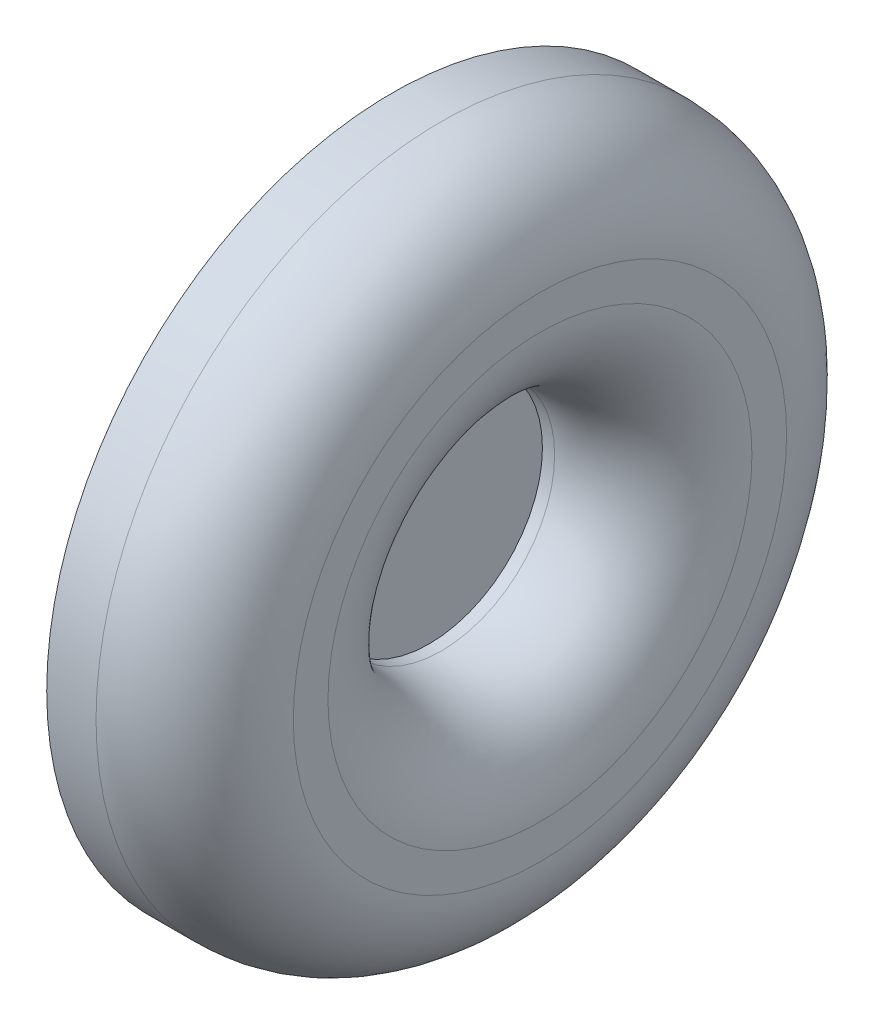
ISO-10303-21;
HEADER;
FILE_DESCRIPTION(('STEP AP214'),'2;1');
FILE_NAME('part.step','',(''),(''),'','','');
FILE_SCHEMA(('AUTOMOTIVE_DESIGN { 1 0 10303 214 1 1 1 1 }'));
ENDSEC;
DATA;
#1=APPLICATION_CONTEXT('core data for automotive mechanical design processes');
#2=APPLICATION_PROTOCOL_DEFINITION('international standard','automotive_design',2000,#1);
#3=PRODUCT_CONTEXT('',#1,'mechanical');
#4=PRODUCT('Part','Part','',(#3));
#5=PRODUCT_RELATED_PRODUCT_CATEGORY('part','',(#4));
#6=PRODUCT_DEFINITION_FORMATION('','',#4);
#7=PRODUCT_DEFINITION_CONTEXT('part definition',#1,'design');
#8=PRODUCT_DEFINITION('design','',#6,#7);
#9=PRODUCT_DEFINITION_SHAPE('','',#8);
#10=(LENGTH_UNIT() NAMED_UNIT(*) SI_UNIT(.MILLI.,.METRE.));
#11=(NAMED_UNIT(*) PLANE_ANGLE_UNIT() SI_UNIT($,.RADIAN.));
#12=(NAMED_UNIT(*) SI_UNIT($,.STERADIAN.) SOLID_ANGLE_UNIT());
#13=UNCERTAINTY_MEASURE_WITH_UNIT(LENGTH_MEASURE(1.E-05),#10,'distance_accuracy_value','');
#14=(GEOMETRIC_REPRESENTATION_CONTEXT(3) GLOBAL_UNCERTAINTY_ASSIGNED_CONTEXT((#13)) GLOBAL_UNIT_ASSIGNED_CONTEXT((#10,
#11,#12)) REPRESENTATION_CONTEXT('',''));
#15=CARTESIAN_POINT('',(0.,0.,0.));
#16=DIRECTION('',(0.,0.,1.));
#17=DIRECTION('',(1.,0.,0.));
#18=AXIS2_PLACEMENT_3D('',#15,#16,#17);
#19=CARTESIAN_POINT('',(0.376236290499869,1.14895757080742,0.));
#20=DIRECTION('',(-1.,0.,0.));
#21=DIRECTION('',(0.,0.,1.));
#22=AXIS2_PLACEMENT_3D('',#19,#20,#21);
#23=PLANE('',#22);
#24=CARTESIAN_POINT('',(0.376236290499869,0.,0.));
#25=DIRECTION('',(-1.,0.,0.));
#26=DIRECTION('',(0.,0.,1.));
#27=AXIS2_PLACEMENT_3D('',#24,#25,#26);
#28=CIRCLE('',#27,1.14895757080742);
#29=CARTESIAN_POINT('',(0.376236290499869,0.,1.14895757080742));
#30=VERTEX_POINT('',#29);
#31=EDGE_CURVE('E10',#30,#30,#28,.T.);
#32=ORIENTED_EDGE('',*,*,#31,.F.);
#33=EDGE_LOOP('',(#32));
#34=FACE_BOUND('',#33,.T.);
#35=ADVANCED_FACE('F15',(#34),#23,.F.);
#36=CARTESIAN_POINT('',(0.,0.,0.));
#37=DIRECTION('',(-1.,0.,0.));
#38=DIRECTION('',(0.,0.,1.));
#39=AXIS2_PLACEMENT_3D('',#36,#37,#38);
#40=CYLINDRICAL_SURFACE('',#39,1.14895757080742);
#41=CARTESIAN_POINT('',(0.499999999999993,0.,0.));
#42=DIRECTION('',(-1.,0.,0.));
#43=DIRECTION('',(0.,0.,1.));
#44=AXIS2_PLACEMENT_3D('',#41,#42,#43);
#45=CIRCLE('',#44,1.14895757080742);
#46=CARTESIAN_POINT('',(0.499999999999993,0.,1.14895757080742));
#47=VERTEX_POINT('',#46);
#48=EDGE_CURVE('E21',#47,#47,#45,.T.);
#49=ORIENTED_EDGE('',*,*,#48,.F.);
#50=EDGE_LOOP('',(#49));
#51=FACE_BOUND('',#50,.T.);
#52=ORIENTED_EDGE('',*,*,#31,.T.);
#53=EDGE_LOOP('',(#52));
#54=FACE_BOUND('',#53,.T.);
#55=ADVANCED_FACE('F63',(#51,#54),#40,.F.);
#56=CARTESIAN_POINT('',(0.5,0.,0.));
#57=DIRECTION('',(-1.,0.,0.));
#58=DIRECTION('',(0.,0.,1.));
#59=AXIS2_PLACEMENT_3D('',#56,#57,#58);
#60=TOROIDAL_SURFACE('',#59,2.14895757080741,1.);
#61=CARTESIAN_POINT('',(1.5,0.,0.));
#62=DIRECTION('',(-1.,0.,0.));
#63=DIRECTION('',(0.,0.,1.));
#64=AXIS2_PLACEMENT_3D('',#61,#62,#63);
#65=CIRCLE('',#64,2.14895757080742);
#66=CARTESIAN_POINT('',(1.5,0.,2.14895757080742));
#67=VERTEX_POINT('',#66);
#68=EDGE_CURVE('E25',#67,#67,#65,.T.);
#69=ORIENTED_EDGE('',*,*,#68,.F.);
#70=EDGE_LOOP('',(#69));
#71=FACE_BOUND('',#70,.T.);
#72=ORIENTED_EDGE('',*,*,#48,.T.);
#73=EDGE_LOOP('',(#72));
#74=FACE_BOUND('',#73,.T.);
#75=ADVANCED_FACE('F58',(#71,#74),#60,.T.);
#76=CARTESIAN_POINT('',(1.5,2.5,0.));
#77=DIRECTION('',(-1.,0.,0.));
#78=DIRECTION('',(0.,0.,1.));
#79=AXIS2_PLACEMENT_3D('',#76,#77,#78);
#80=PLANE('',#79);
#81=CARTESIAN_POINT('',(1.5,0.,0.));
#82=DIRECTION('',(-1.,0.,0.));
#83=DIRECTION('',(0.,0.,1.));
#84=AXIS2_PLACEMENT_3D('',#81,#82,#83);
#85=CIRCLE('',#84,2.5);
#86=CARTESIAN_POINT('',(1.5,0.,2.5));
#87=VERTEX_POINT('',#86);
#88=EDGE_CURVE('E29',#87,#87,#85,.T.);
#89=ORIENTED_EDGE('',*,*,#88,.F.);
#90=EDGE_LOOP('',(#89));
#91=FACE_BOUND('',#90,.T.);
#92=ORIENTED_EDGE('',*,*,#68,.T.);
#93=EDGE_LOOP('',(#92));
#94=FACE_BOUND('',#93,.T.);
#95=ADVANCED_FACE('F52',(#91,#94),#80,.F.);
#96=CARTESIAN_POINT('',(0.5,0.,0.));
#97=DIRECTION('',(-1.,0.,0.));
#98=DIRECTION('',(0.,0.,1.));
#99=AXIS2_PLACEMENT_3D('',#96,#97,#98);
#100=TOROIDAL_SURFACE('',#99,2.5,1.);
#101=CARTESIAN_POINT('',(0.499999999999993,0.,0.));
#102=DIRECTION('',(-1.,0.,0.));
#103=DIRECTION('',(0.,0.,1.));
#104=AXIS2_PLACEMENT_3D('',#101,#102,#103);
#105=CIRCLE('',#104,3.5);
#106=CARTESIAN_POINT('',(0.499999999999993,0.,3.5));
#107=VERTEX_POINT('',#106);
#108=EDGE_CURVE('E34',#107,#107,#105,.T.);
#109=ORIENTED_EDGE('',*,*,#108,.F.);
#110=EDGE_LOOP('',(#109));
#111=FACE_BOUND('',#110,.T.);
#112=ORIENTED_EDGE('',*,*,#88,.T.);
#113=EDGE_LOOP('',(#112));
#114=FACE_BOUND('',#113,.T.);
#115=ADVANCED_FACE('F46',(#111,#114),#100,.T.);
#116=CARTESIAN_POINT('',(0.,0.,0.));
#117=DIRECTION('',(-1.,0.,0.));
#118=DIRECTION('',(0.,0.,1.));
#119=AXIS2_PLACEMENT_3D('',#116,#117,#118);
#120=CYLINDRICAL_SURFACE('',#119,3.5);
#121=CARTESIAN_POINT('',(0.,0.,0.));
#122=DIRECTION('',(-1.,0.,0.));
#123=DIRECTION('',(0.,0.,1.));
#124=AXIS2_PLACEMENT_3D('',#121,#122,#123);
#125=CIRCLE('',#124,3.5);
#126=CARTESIAN_POINT('',(0.,0.,3.5));
#127=VERTEX_POINT('',#126);
#128=EDGE_CURVE('E37',#127,#127,#125,.T.);
#129=ORIENTED_EDGE('',*,*,#128,.F.);
#130=EDGE_LOOP('',(#129));
#131=FACE_BOUND('',#130,.T.);
#132=ORIENTED_EDGE('',*,*,#108,.T.);
#133=EDGE_LOOP('',(#132));
#134=FACE_BOUND('',#133,.T.);
#135=ADVANCED_FACE('F43',(#131,#134),#120,.T.);
#136=CARTESIAN_POINT('',(0.,0.,0.));
#137=DIRECTION('',(1.,0.,0.));
#138=DIRECTION('',(0.,0.,-1.));
#139=AXIS2_PLACEMENT_3D('',#136,#137,#138);
#140=PLANE('',#139);
#141=ORIENTED_EDGE('',*,*,#128,.T.);
#142=EDGE_LOOP('',(#141));
#143=FACE_BOUND('',#142,.T.);
#144=ADVANCED_FACE('F41',(#143),#140,.F.);
#145=CLOSED_SHELL('',(#35,#55,#75,#95,#115,#135,#144));
#146=MANIFOLD_SOLID_BREP('B1',#145);
#147=ADVANCED_BREP_SHAPE_REPRESENTATION('',(#18,#146),#14);
#148=SHAPE_DEFINITION_REPRESENTATION(#9,#147);
ENDSEC;
END-ISO-10303-21;
